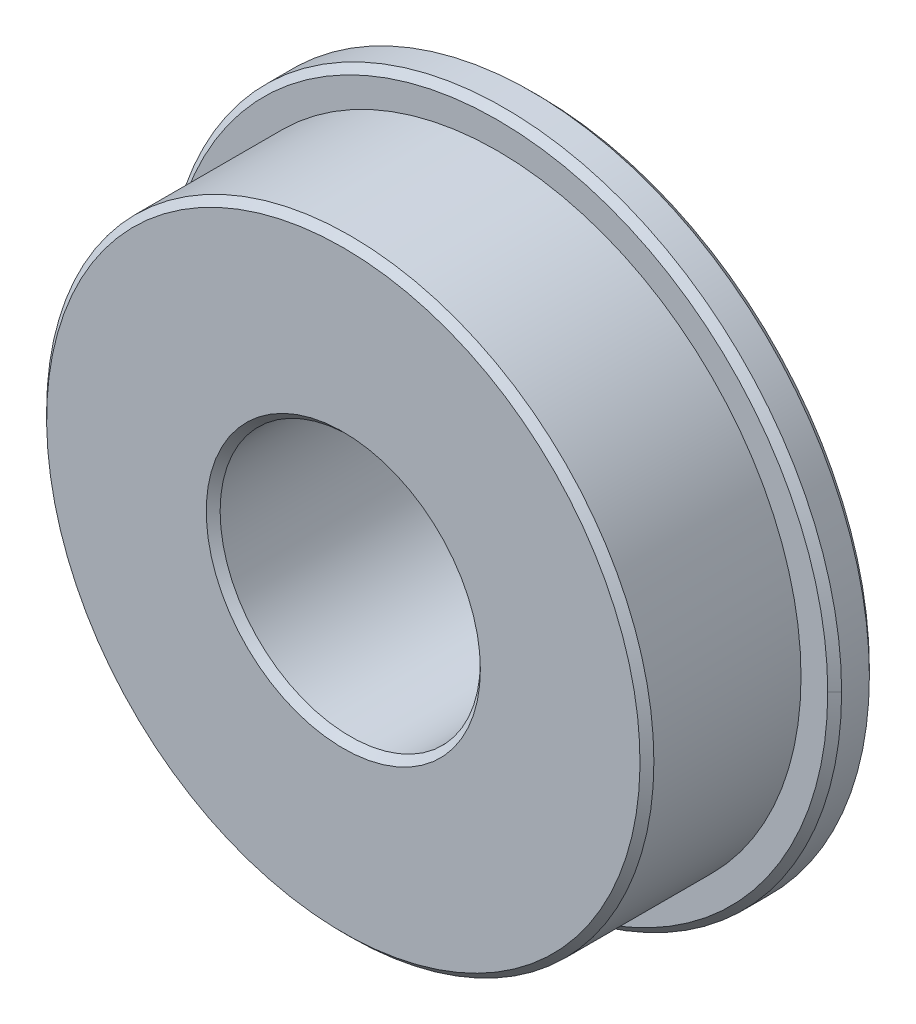
ISO-10303-21;
HEADER;
FILE_DESCRIPTION(('STEP AP214'),'2;1');
FILE_NAME('part.step','',(''),(''),'','','');
FILE_SCHEMA(('AUTOMOTIVE_DESIGN { 1 0 10303 214 1 1 1 1 }'));
ENDSEC;
DATA;
#1=APPLICATION_CONTEXT('core data for automotive mechanical design processes');
#2=APPLICATION_PROTOCOL_DEFINITION('international standard','automotive_design',2000,#1);
#3=PRODUCT_CONTEXT('',#1,'mechanical');
#4=PRODUCT('Part','Part','',(#3));
#5=PRODUCT_RELATED_PRODUCT_CATEGORY('part','',(#4));
#6=PRODUCT_DEFINITION_FORMATION('','',#4);
#7=PRODUCT_DEFINITION_CONTEXT('part definition',#1,'design');
#8=PRODUCT_DEFINITION('design','',#6,#7);
#9=PRODUCT_DEFINITION_SHAPE('','',#8);
#10=(LENGTH_UNIT() NAMED_UNIT(*) SI_UNIT(.MILLI.,.METRE.));
#11=(NAMED_UNIT(*) PLANE_ANGLE_UNIT() SI_UNIT($,.RADIAN.));
#12=(NAMED_UNIT(*) SI_UNIT($,.STERADIAN.) SOLID_ANGLE_UNIT());
#13=UNCERTAINTY_MEASURE_WITH_UNIT(LENGTH_MEASURE(1.E-05),#10,'distance_accuracy_value','');
#14=(GEOMETRIC_REPRESENTATION_CONTEXT(3) GLOBAL_UNCERTAINTY_ASSIGNED_CONTEXT((#13)) GLOBAL_UNIT_ASSIGNED_CONTEXT((#10,
#11,#12)) REPRESENTATION_CONTEXT('',''));
#15=CARTESIAN_POINT('',(0.,0.,0.));
#16=DIRECTION('',(0.,0.,1.));
#17=DIRECTION('',(1.,0.,0.));
#18=AXIS2_PLACEMENT_3D('',#15,#16,#17);
#19=CARTESIAN_POINT('',(-8.86153846180001,6.04195804306,0.));
#20=DIRECTION('',(0.,0.,1.));
#21=DIRECTION('',(1.,0.,0.));
#22=AXIS2_PLACEMENT_3D('',#19,#20,#21);
#23=CONICAL_SURFACE('',#22,12.0904,0.78539816339745);
#24=DIRECTION('',(-0.707106780832995,0.,0.7071067815401));
#25=VECTOR('',#24,1.);
#26=CARTESIAN_POINT('',(-21.0789384618,6.04195804306,0.127000000127));
#27=LINE('',#26,#25);
#28=CARTESIAN_POINT('',(-20.9519384618,6.04195804306,0.));
#29=VERTEX_POINT('',#28);
#30=CARTESIAN_POINT('',(-21.2059384618318,6.04195804306,0.25400000047625));
#31=VERTEX_POINT('',#30);
#32=EDGE_CURVE('E53',#29,#31,#27,.T.);
#33=ORIENTED_EDGE('',*,*,#32,.T.);
#34=CARTESIAN_POINT('',(-8.86153846180001,6.04195804306,0.254000000508));
#35=DIRECTION('',(0.,0.,1.));
#36=DIRECTION('',(1.,0.,0.));
#37=AXIS2_PLACEMENT_3D('',#34,#35,#36);
#38=CIRCLE('',#37,12.3444);
#39=CARTESIAN_POINT('',(3.48286153823175,6.04195804306,0.25400000047625));
#40=VERTEX_POINT('',#39);
#41=EDGE_CURVE('E60',#31,#40,#38,.F.);
#42=ORIENTED_EDGE('',*,*,#41,.T.);
#43=DIRECTION('',(-0.707106780832995,0.,-0.7071067815401));
#44=VECTOR('',#43,1.);
#45=CARTESIAN_POINT('',(3.35586153819999,6.04195804306,0.127000000127));
#46=LINE('',#45,#44);
#47=CARTESIAN_POINT('',(3.2288615382,6.04195804306,0.));
#48=VERTEX_POINT('',#47);
#49=EDGE_CURVE('E105',#40,#48,#46,.T.);
#50=ORIENTED_EDGE('',*,*,#49,.T.);
#51=CARTESIAN_POINT('',(-8.86153846180001,6.04195804306,0.));
#52=DIRECTION('',(0.,0.,1.));
#53=DIRECTION('',(1.,0.,0.));
#54=AXIS2_PLACEMENT_3D('',#51,#52,#53);
#55=CIRCLE('',#54,12.0904);
#56=EDGE_CURVE('E20',#48,#29,#55,.T.);
#57=ORIENTED_EDGE('',*,*,#56,.T.);
#58=EDGE_LOOP('',(#33,#42,#50,#57));
#59=FACE_BOUND('',#58,.T.);
#60=ADVANCED_FACE('F17',(#59),#23,.T.);
#61=CARTESIAN_POINT('',(-8.86153846180001,6.04195804306,0.));
#62=DIRECTION('',(0.,0.,1.));
#63=DIRECTION('',(1.,0.,0.));
#64=AXIS2_PLACEMENT_3D('',#61,#62,#63);
#65=CONICAL_SURFACE('',#64,12.0904,0.78539816289745);
#66=CARTESIAN_POINT('',(-8.86153846180001,6.04195804306,0.));
#67=DIRECTION('',(0.,0.,1.));
#68=DIRECTION('',(1.,0.,0.));
#69=AXIS2_PLACEMENT_3D('',#66,#67,#68);
#70=CIRCLE('',#69,12.0904);
#71=EDGE_CURVE('E99',#29,#48,#70,.T.);
#72=ORIENTED_EDGE('',*,*,#71,.T.);
#73=ORIENTED_EDGE('',*,*,#49,.F.);
#74=CARTESIAN_POINT('',(-8.86153846180001,6.04195804306,0.254000000508));
#75=DIRECTION('',(0.,0.,1.));
#76=DIRECTION('',(-1.,0.,0.));
#77=AXIS2_PLACEMENT_3D('',#74,#75,#76);
#78=CIRCLE('',#77,12.3444);
#79=EDGE_CURVE('E98',#40,#31,#78,.F.);
#80=ORIENTED_EDGE('',*,*,#79,.T.);
#81=ORIENTED_EDGE('',*,*,#32,.F.);
#82=EDGE_LOOP('',(#72,#73,#80,#81));
#83=FACE_BOUND('',#82,.T.);
#84=ADVANCED_FACE('F124',(#83),#65,.T.);
#85=CARTESIAN_POINT('',(0.,0.,0.));
#86=DIRECTION('',(0.,0.,-1.));
#87=DIRECTION('',(-1.,0.,0.));
#88=AXIS2_PLACEMENT_3D('',#85,#86,#87);
#89=PLANE('',#88);
#90=CARTESIAN_POINT('',(-8.86153846180001,6.04195804306,0.));
#91=DIRECTION('',(0.,0.,-1.));
#92=DIRECTION('',(0.,1.,0.));
#93=AXIS2_PLACEMENT_3D('',#90,#91,#92);
#94=CIRCLE('',#93,5.0165);
#95=CARTESIAN_POINT('',(-8.86153846180001,11.05845804306,0.));
#96=VERTEX_POINT('',#95);
#97=EDGE_CURVE('E78',#96,#96,#94,.F.);
#98=ORIENTED_EDGE('',*,*,#97,.T.);
#99=EDGE_LOOP('',(#98));
#100=FACE_BOUND('',#99,.T.);
#101=ORIENTED_EDGE('',*,*,#56,.F.);
#102=ORIENTED_EDGE('',*,*,#71,.F.);
#103=EDGE_LOOP('',(#101,#102));
#104=FACE_BOUND('',#103,.T.);
#105=ADVANCED_FACE('F127',(#100,#104),#89,.T.);
#106=CARTESIAN_POINT('',(-8.86153846180001,6.04195804306,0.254000000508));
#107=DIRECTION('',(0.,0.,1.));
#108=DIRECTION('',(1.,0.,0.));
#109=AXIS2_PLACEMENT_3D('',#106,#107,#108);
#110=CYLINDRICAL_SURFACE('',#109,12.3444);
#111=CARTESIAN_POINT('',(-8.86153846180001,6.04195804306,1.269999999873));
#112=DIRECTION('',(0.,0.,-1.));
#113=DIRECTION('',(1.,0.,0.));
#114=AXIS2_PLACEMENT_3D('',#111,#112,#113);
#115=CIRCLE('',#114,12.344399999873);
#116=CARTESIAN_POINT('',(3.4828615381365,6.04195804306,1.269999999746));
#117=VERTEX_POINT('',#116);
#118=CARTESIAN_POINT('',(-21.2059384617365,6.04195804306,1.269999999746));
#119=VERTEX_POINT('',#118);
#120=EDGE_CURVE('E68',#117,#119,#115,.T.);
#121=ORIENTED_EDGE('',*,*,#120,.T.);
#122=CARTESIAN_POINT('',(-8.86153846180001,6.04195804306,1.27));
#123=DIRECTION('',(0.,0.,-1.));
#124=DIRECTION('',(-1.,0.,0.));
#125=AXIS2_PLACEMENT_3D('',#122,#123,#124);
#126=CIRCLE('',#125,12.3444);
#127=EDGE_CURVE('E74',#119,#117,#126,.T.);
#128=ORIENTED_EDGE('',*,*,#127,.T.);
#129=EDGE_LOOP('',(#121,#128));
#130=FACE_BOUND('',#129,.T.);
#131=ORIENTED_EDGE('',*,*,#79,.F.);
#132=ORIENTED_EDGE('',*,*,#41,.F.);
#133=EDGE_LOOP('',(#131,#132));
#134=FACE_BOUND('',#133,.T.);
#135=ADVANCED_FACE('F76',(#130,#134),#110,.T.);
#136=CARTESIAN_POINT('',(-8.86153846180001,6.04195804306,0.254));
#137=DIRECTION('',(0.,0.,-1.));
#138=DIRECTION('',(0.,1.,0.));
#139=AXIS2_PLACEMENT_3D('',#136,#137,#138);
#140=CONICAL_SURFACE('',#139,4.7625,0.785398163397448);
#141=ORIENTED_EDGE('',*,*,#97,.F.);
#142=EDGE_LOOP('',(#141));
#143=FACE_BOUND('',#142,.T.);
#144=CARTESIAN_POINT('',(-8.86153846180001,6.04195804306,0.254000000508));
#145=DIRECTION('',(0.,0.,1.));
#146=DIRECTION('',(-1.,0.,0.));
#147=AXIS2_PLACEMENT_3D('',#144,#145,#146);
#148=CIRCLE('',#147,4.7625);
#149=CARTESIAN_POINT('',(-13.6240384618,6.04195804306,0.254000000508));
#150=VERTEX_POINT('',#149);
#151=EDGE_CURVE('E83',#150,#150,#148,.T.);
#152=ORIENTED_EDGE('',*,*,#151,.T.);
#153=EDGE_LOOP('',(#152));
#154=FACE_BOUND('',#153,.T.);
#155=ADVANCED_FACE('F126',(#143,#154),#140,.F.);
#156=CARTESIAN_POINT('',(-8.86153846180001,6.04195804306,1.524));
#157=DIRECTION('',(0.,0.,-1.));
#158=DIRECTION('',(0.,1.,0.));
#159=AXIS2_PLACEMENT_3D('',#156,#157,#158);
#160=CONICAL_SURFACE('',#159,12.0904,0.78539816339745);
#161=DIRECTION('',(0.707106780832994,0.,-0.707106781540101));
#162=VECTOR('',#161,1.);
#163=CARTESIAN_POINT('',(3.3558615382,6.04195804306,1.396999999873));
#164=LINE('',#163,#162);
#165=CARTESIAN_POINT('',(3.2288615382,6.04195804306,1.524));
#166=VERTEX_POINT('',#165);
#167=EDGE_CURVE('E35',#166,#117,#164,.T.);
#168=ORIENTED_EDGE('',*,*,#167,.T.);
#169=ORIENTED_EDGE('',*,*,#127,.F.);
#170=DIRECTION('',(0.707106780832995,0.,0.7071067815401));
#171=VECTOR('',#170,1.);
#172=CARTESIAN_POINT('',(-21.0789384618,6.04195804306,1.396999999873));
#173=LINE('',#172,#171);
#174=CARTESIAN_POINT('',(-20.9519384618,6.04195804306,1.524));
#175=VERTEX_POINT('',#174);
#176=EDGE_CURVE('E72',#119,#175,#173,.T.);
#177=ORIENTED_EDGE('',*,*,#176,.T.);
#178=CARTESIAN_POINT('',(-8.86153846180001,6.04195804306,1.524));
#179=DIRECTION('',(0.,0.,-1.));
#180=DIRECTION('',(0.,1.,0.));
#181=AXIS2_PLACEMENT_3D('',#178,#179,#180);
#182=CIRCLE('',#181,12.0904);
#183=EDGE_CURVE('E82',#175,#166,#182,.T.);
#184=ORIENTED_EDGE('',*,*,#183,.T.);
#185=EDGE_LOOP('',(#168,#169,#177,#184));
#186=FACE_BOUND('',#185,.T.);
#187=ADVANCED_FACE('F81',(#186),#160,.T.);
#188=CARTESIAN_POINT('',(-8.86153846180001,6.04195804306,1.524));
#189=DIRECTION('',(0.,0.,-1.));
#190=DIRECTION('',(0.,1.,0.));
#191=AXIS2_PLACEMENT_3D('',#188,#189,#190);
#192=CONICAL_SURFACE('',#191,12.0904,0.78539816289745);
#193=CARTESIAN_POINT('',(-8.86153846180001,6.04195804306,1.524));
#194=DIRECTION('',(0.,0.,-1.));
#195=DIRECTION('',(0.,1.,0.));
#196=AXIS2_PLACEMENT_3D('',#193,#194,#195);
#197=CIRCLE('',#196,12.0904);
#198=EDGE_CURVE('E119',#166,#175,#197,.T.);
#199=ORIENTED_EDGE('',*,*,#198,.T.);
#200=ORIENTED_EDGE('',*,*,#176,.F.);
#201=ORIENTED_EDGE('',*,*,#120,.F.);
#202=ORIENTED_EDGE('',*,*,#167,.F.);
#203=EDGE_LOOP('',(#199,#200,#201,#202));
#204=FACE_BOUND('',#203,.T.);
#205=ADVANCED_FACE('F70',(#204),#192,.T.);
#206=CARTESIAN_POINT('',(-8.86153846180001,6.04195804306,0.254000000508));
#207=DIRECTION('',(0.,0.,1.));
#208=DIRECTION('',(1.,0.,0.));
#209=AXIS2_PLACEMENT_3D('',#206,#207,#208);
#210=CYLINDRICAL_SURFACE('',#209,4.7625);
#211=ORIENTED_EDGE('',*,*,#151,.F.);
#212=EDGE_LOOP('',(#211));
#213=FACE_BOUND('',#212,.T.);
#214=CARTESIAN_POINT('',(-8.86153846180001,6.04195804306,6.9088));
#215=DIRECTION('',(0.,0.,1.));
#216=DIRECTION('',(-1.,0.,0.));
#217=AXIS2_PLACEMENT_3D('',#214,#215,#216);
#218=CIRCLE('',#217,4.7625);
#219=CARTESIAN_POINT('',(-13.6240384618,6.04195804306,6.9088));
#220=VERTEX_POINT('',#219);
#221=EDGE_CURVE('E118',#220,#220,#218,.T.);
#222=ORIENTED_EDGE('',*,*,#221,.T.);
#223=EDGE_LOOP('',(#222));
#224=FACE_BOUND('',#223,.T.);
#225=ADVANCED_FACE('F162',(#213,#224),#210,.F.);
#226=CARTESIAN_POINT('',(0.,0.,1.52399999974194));
#227=DIRECTION('',(0.,0.,-1.));
#228=DIRECTION('',(-1.,0.,0.));
#229=AXIS2_PLACEMENT_3D('',#226,#227,#228);
#230=PLANE('',#229);
#231=CARTESIAN_POINT('',(-8.86153846180001,6.04195804306,1.523999999238));
#232=DIRECTION('',(0.,0.,1.));
#233=DIRECTION('',(0.,-1.,0.));
#234=AXIS2_PLACEMENT_3D('',#231,#232,#233);
#235=CIRCLE('',#234,11.112500000254);
#236=CARTESIAN_POINT('',(-8.86153846180001,-5.07054195719401,1.523999999238));
#237=VERTEX_POINT('',#236);
#238=EDGE_CURVE('E115',#237,#237,#235,.F.);
#239=ORIENTED_EDGE('',*,*,#238,.T.);
#240=EDGE_LOOP('',(#239));
#241=FACE_BOUND('',#240,.T.);
#242=ORIENTED_EDGE('',*,*,#183,.F.);
#243=ORIENTED_EDGE('',*,*,#198,.F.);
#244=EDGE_LOOP('',(#242,#243));
#245=FACE_BOUND('',#244,.T.);
#246=ADVANCED_FACE('F158',(#241,#245),#230,.F.);
#247=CARTESIAN_POINT('',(-8.86153846180001,6.04195804306,6.9088));
#248=DIRECTION('',(0.,0.,1.));
#249=DIRECTION('',(1.,0.,0.));
#250=AXIS2_PLACEMENT_3D('',#247,#248,#249);
#251=CONICAL_SURFACE('',#250,4.7625,0.78539816339745);
#252=CARTESIAN_POINT('',(-8.86153846180001,6.04195804306,7.1628));
#253=DIRECTION('',(0.,0.,1.));
#254=DIRECTION('',(1.,0.,0.));
#255=AXIS2_PLACEMENT_3D('',#252,#253,#254);
#256=CIRCLE('',#255,5.0165);
#257=CARTESIAN_POINT('',(-3.84503846180001,6.04195804306,7.1628));
#258=VERTEX_POINT('',#257);
#259=EDGE_CURVE('E112',#258,#258,#256,.T.);
#260=ORIENTED_EDGE('',*,*,#259,.T.);
#261=EDGE_LOOP('',(#260));
#262=FACE_BOUND('',#261,.T.);
#263=ORIENTED_EDGE('',*,*,#221,.F.);
#264=EDGE_LOOP('',(#263));
#265=FACE_BOUND('',#264,.T.);
#266=ADVANCED_FACE('F154',(#262,#265),#251,.F.);
#267=CARTESIAN_POINT('',(-8.86153846180001,6.04195804306,1.523999999238));
#268=DIRECTION('',(0.,0.,1.));
#269=DIRECTION('',(0.,-1.,0.));
#270=AXIS2_PLACEMENT_3D('',#267,#268,#269);
#271=CYLINDRICAL_SURFACE('',#270,11.112500000254);
#272=ORIENTED_EDGE('',*,*,#238,.F.);
#273=EDGE_LOOP('',(#272));
#274=FACE_BOUND('',#273,.T.);
#275=CARTESIAN_POINT('',(-8.86153846180001,6.04195804306,6.9088));
#276=DIRECTION('',(0.,0.,-1.));
#277=DIRECTION('',(-1.,0.,0.));
#278=AXIS2_PLACEMENT_3D('',#275,#276,#277);
#279=CIRCLE('',#278,11.1125);
#280=CARTESIAN_POINT('',(-19.9740384618,6.04195804306,6.9088));
#281=VERTEX_POINT('',#280);
#282=EDGE_CURVE('E26',#281,#281,#279,.T.);
#283=ORIENTED_EDGE('',*,*,#282,.T.);
#284=EDGE_LOOP('',(#283));
#285=FACE_BOUND('',#284,.T.);
#286=ADVANCED_FACE('F146',(#274,#285),#271,.T.);
#287=CARTESIAN_POINT('',(0.,0.,7.16279999698065));
#288=DIRECTION('',(0.,0.,-1.));
#289=DIRECTION('',(-1.,0.,0.));
#290=AXIS2_PLACEMENT_3D('',#287,#288,#289);
#291=PLANE('',#290);
#292=ORIENTED_EDGE('',*,*,#259,.F.);
#293=EDGE_LOOP('',(#292));
#294=FACE_BOUND('',#293,.T.);
#295=CARTESIAN_POINT('',(-8.86153846180001,6.04195804306,7.1628));
#296=DIRECTION('',(0.,0.,-1.));
#297=DIRECTION('',(0.,1.,0.));
#298=AXIS2_PLACEMENT_3D('',#295,#296,#297);
#299=CIRCLE('',#298,10.8585);
#300=CARTESIAN_POINT('',(-8.86153846180001,16.90045804306,7.1628));
#301=VERTEX_POINT('',#300);
#302=EDGE_CURVE('E11',#301,#301,#299,.F.);
#303=ORIENTED_EDGE('',*,*,#302,.T.);
#304=EDGE_LOOP('',(#303));
#305=FACE_BOUND('',#304,.T.);
#306=ADVANCED_FACE('F140',(#294,#305),#291,.F.);
#307=CARTESIAN_POINT('',(-8.86153846180001,6.04195804306,7.1628));
#308=DIRECTION('',(0.,0.,-1.));
#309=DIRECTION('',(0.,1.,0.));
#310=AXIS2_PLACEMENT_3D('',#307,#308,#309);
#311=CONICAL_SURFACE('',#310,10.8585,0.78539816339745);
#312=ORIENTED_EDGE('',*,*,#302,.F.);
#313=EDGE_LOOP('',(#312));
#314=FACE_BOUND('',#313,.T.);
#315=ORIENTED_EDGE('',*,*,#282,.F.);
#316=EDGE_LOOP('',(#315));
#317=FACE_BOUND('',#316,.T.);
#318=ADVANCED_FACE('F138',(#314,#317),#311,.T.);
#319=CLOSED_SHELL('',(#60,#84,#105,#135,#155,#187,#205,#225,#246,#266,#286,#306,#318));
#320=MANIFOLD_SOLID_BREP('B1',#319);
#321=ADVANCED_BREP_SHAPE_REPRESENTATION('',(#18,#320),#14);
#322=SHAPE_DEFINITION_REPRESENTATION(#9,#321);
ENDSEC;
END-ISO-10303-21;
